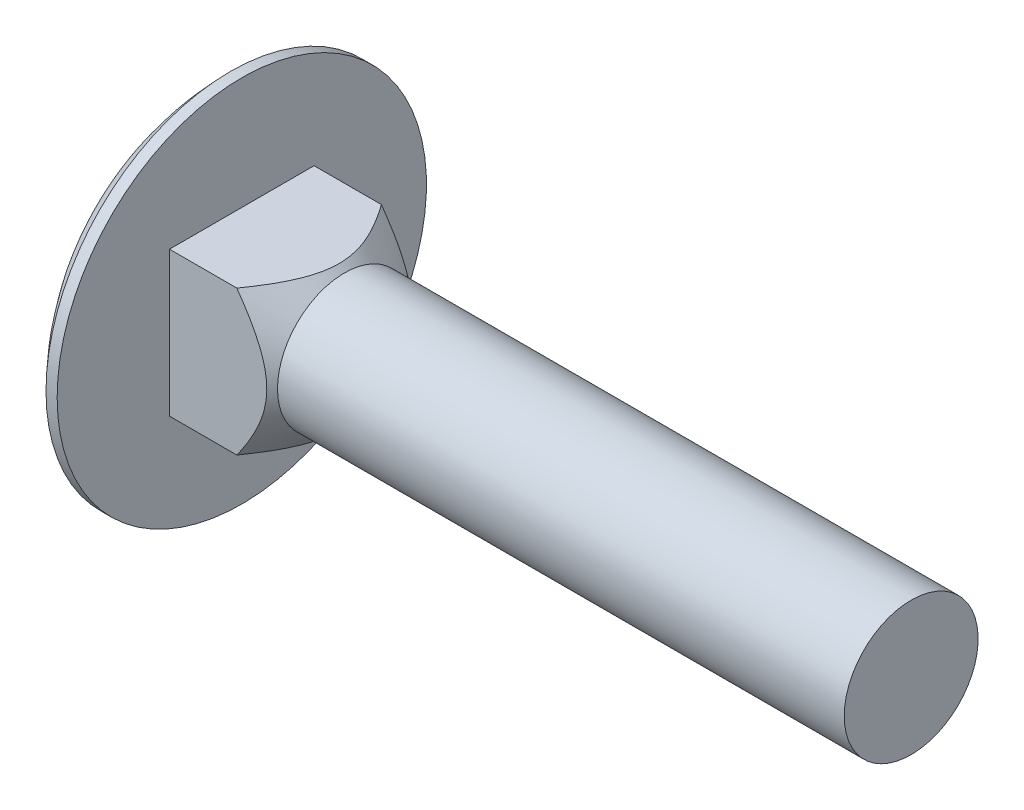
ISO-10303-21;
HEADER;
FILE_DESCRIPTION(('STEP AP214'),'2;1');
FILE_NAME('part.step','',(''),(''),'','','');
FILE_SCHEMA(('AUTOMOTIVE_DESIGN { 1 0 10303 214 1 1 1 1 }'));
ENDSEC;
DATA;
#1=APPLICATION_CONTEXT('core data for automotive mechanical design processes');
#2=APPLICATION_PROTOCOL_DEFINITION('international standard','automotive_design',2000,#1);
#3=PRODUCT_CONTEXT('',#1,'mechanical');
#4=PRODUCT('Part','Part','',(#3));
#5=PRODUCT_RELATED_PRODUCT_CATEGORY('part','',(#4));
#6=PRODUCT_DEFINITION_FORMATION('','',#4);
#7=PRODUCT_DEFINITION_CONTEXT('part definition',#1,'design');
#8=PRODUCT_DEFINITION('design','',#6,#7);
#9=PRODUCT_DEFINITION_SHAPE('','',#8);
#10=(LENGTH_UNIT() NAMED_UNIT(*) SI_UNIT(.MILLI.,.METRE.));
#11=(NAMED_UNIT(*) PLANE_ANGLE_UNIT() SI_UNIT($,.RADIAN.));
#12=(NAMED_UNIT(*) SI_UNIT($,.STERADIAN.) SOLID_ANGLE_UNIT());
#13=UNCERTAINTY_MEASURE_WITH_UNIT(LENGTH_MEASURE(1.E-05),#10,'distance_accuracy_value','');
#14=(GEOMETRIC_REPRESENTATION_CONTEXT(3) GLOBAL_UNCERTAINTY_ASSIGNED_CONTEXT((#13)) GLOBAL_UNIT_ASSIGNED_CONTEXT((#10,
#11,#12)) REPRESENTATION_CONTEXT('',''));
#15=CARTESIAN_POINT('',(0.,0.,0.));
#16=DIRECTION('',(0.,0.,1.));
#17=DIRECTION('',(1.,0.,0.));
#18=AXIS2_PLACEMENT_3D('',#15,#16,#17);
#19=CARTESIAN_POINT('',(4.6,3.24,-3.24));
#20=DIRECTION('',(0.,0.,1.));
#21=DIRECTION('',(0.,-1.,0.));
#22=AXIS2_PLACEMENT_3D('',#19,#20,#21);
#23=PLANE('',#22);
#24=CARTESIAN_POINT('',(0.120416170125069,-6.7414074397063,-3.24));
#25=CARTESIAN_POINT('',(0.25736062873696,-6.58944728740927,-3.24));
#26=CARTESIAN_POINT('',(0.393846815573473,-6.43707070925382,-3.24));
#27=CARTESIAN_POINT('',(0.665661123863793,-6.1312671177515,-3.24));
#28=CARTESIAN_POINT('',(0.800989152901168,-5.97784002230384,-3.24));
#29=CARTESIAN_POINT('',(1.07065702082592,-5.66924612356482,-3.24));
#30=CARTESIAN_POINT('',(1.20499227924482,-5.51407531108393,-3.24));
#31=CARTESIAN_POINT('',(1.47186716195841,-5.20220433515908,-3.24));
#32=CARTESIAN_POINT('',(1.60440684975769,-5.04550422614131,-3.24));
#33=CARTESIAN_POINT('',(1.87469625252643,-4.72122756794267,-3.24));
#34=CARTESIAN_POINT('',(2.0123128694796,-4.55353979098877,-3.24));
#35=CARTESIAN_POINT('',(2.28420008970127,-4.21547552728753,-3.24));
#36=CARTESIAN_POINT('',(2.41847084769173,-4.04509916546525,-3.24));
#37=CARTESIAN_POINT('',(2.68232627861573,-3.70109336187763,-3.24));
#38=CARTESIAN_POINT('',(2.8119168313737,-3.52746844969524,-3.24));
#39=CARTESIAN_POINT('',(3.06482061537789,-3.17572665708054,-3.24));
#40=CARTESIAN_POINT('',(3.1881354498348,-2.99761094144419,-3.24));
#41=CARTESIAN_POINT('',(3.39832133154884,-2.67722310032235,-3.24));
#42=CARTESIAN_POINT('',(3.48703467285581,-2.53616652454108,-3.24));
#43=CARTESIAN_POINT('',(3.65726255713617,-2.24964032099177,-3.24));
#44=CARTESIAN_POINT('',(3.73877395380492,-2.10416880139295,-3.24));
#45=CARTESIAN_POINT('',(3.89115652633997,-1.80934032100822,-3.24));
#46=CARTESIAN_POINT('',(3.9621164219209,-1.6600298009873,-3.24));
#47=CARTESIAN_POINT('',(4.09050683146268,-1.35569473684555,-3.24));
#48=CARTESIAN_POINT('',(4.14795039693274,-1.20067587347206,-3.24));
#49=CARTESIAN_POINT('',(4.22558846779131,-0.947273628729252,-3.24));
#50=CARTESIAN_POINT('',(4.25153996125965,-0.850655334613169,-3.24));
#51=CARTESIAN_POINT('',(4.29568982309763,-0.655648600709393,-3.24));
#52=CARTESIAN_POINT('',(4.31388942032129,-0.557260444064855,-3.24));
#53=CARTESIAN_POINT('',(4.34156684156055,-0.359610820542335,-3.24));
#54=CARTESIAN_POINT('',(4.35107602439263,-0.260353808887043,-3.24));
#55=CARTESIAN_POINT('',(4.36094183170725,-0.0613794653984506,-3.24));
#56=CARTESIAN_POINT('',(4.36129862388183,0.0383378579674386,-3.24));
#57=CARTESIAN_POINT('',(4.35283832123334,0.237378603091908,-3.24));
#58=CARTESIAN_POINT('',(4.34402096142676,0.336702013389639,-3.24));
#59=CARTESIAN_POINT('',(4.31771918406241,0.534183700378543,-3.24));
#60=CARTESIAN_POINT('',(4.30023406582596,0.632341882218774,-3.24));
#61=CARTESIAN_POINT('',(4.2573945237995,0.827349246915,-3.24));
#62=CARTESIAN_POINT('',(4.23200622025648,0.92419088407423,-3.24));
#63=CARTESIAN_POINT('',(4.17446445699154,1.11581908212014,-3.24));
#64=CARTESIAN_POINT('',(4.14231079903122,1.21060558269742,-3.24));
#65=CARTESIAN_POINT('',(4.06453950116689,1.41886565569307,-3.24));
#66=CARTESIAN_POINT('',(4.01751768475131,1.53181153534013,-3.24));
#67=CARTESIAN_POINT('',(3.91671541361205,1.75467118579228,-3.24));
#68=CARTESIAN_POINT('',(3.86293162642795,1.86458342875213,-3.24));
#69=CARTESIAN_POINT('',(3.74994199449218,2.08181831427032,-3.24));
#70=CARTESIAN_POINT('',(3.6907264258951,2.18913586031061,-3.24));
#71=CARTESIAN_POINT('',(3.56808414719841,2.4012987068335,-3.24));
#72=CARTESIAN_POINT('',(3.50465808606051,2.506144384944,-3.24));
#73=CARTESIAN_POINT('',(3.37351714683084,2.71519344454569,-3.24));
#74=CARTESIAN_POINT('',(3.30575408304881,2.81936645688851,-3.24));
#75=CARTESIAN_POINT('',(3.16745091463218,3.02584962244193,-3.24));
#76=CARTESIAN_POINT('',(3.09691072677368,3.12815971969076,-3.24));
#77=CARTESIAN_POINT('',(2.95366014171693,3.33107037702131,-3.24));
#78=CARTESIAN_POINT('',(2.88095230175738,3.4316727476446,-3.24));
#79=CARTESIAN_POINT('',(2.73369585527417,3.63151137580475,-3.24));
#80=CARTESIAN_POINT('',(2.65914732418408,3.73074768906542,-3.24));
#81=CARTESIAN_POINT('',(2.48904411673983,3.95356950466048,-3.24));
#82=CARTESIAN_POINT('',(2.3930434080346,4.07681415039384,-3.24));
#83=CARTESIAN_POINT('',(2.19910117753357,4.32176885465257,-3.24));
#84=CARTESIAN_POINT('',(2.10115959026957,4.44347886118535,-3.24));
#85=CARTESIAN_POINT('',(1.80496346206786,4.80672536138743,-3.24));
#86=CARTESIAN_POINT('',(1.60436164100984,5.04634718705188,-3.24));
#87=CARTESIAN_POINT('',(1.19880495079559,5.52205280844775,-3.24));
#88=CARTESIAN_POINT('',(0.99384804230474,5.75813485425661,-3.24));
#89=CARTESIAN_POINT('',(0.580866742988496,6.22760655736332,-3.24));
#90=CARTESIAN_POINT('',(0.372842273678394,6.46099614550038,-3.24));
#91=CARTESIAN_POINT('',(-0.0459273377027709,6.92624626345974,-3.24));
#92=CARTESIAN_POINT('',(-0.256677452858743,7.15810230761016,-3.24));
#93=CARTESIAN_POINT('',(-0.679912188418046,7.62023065825678,-3.24));
#94=CARTESIAN_POINT('',(-0.892396836514393,7.85050293935853,-3.24));
#95=CARTESIAN_POINT('',(-1.53171588603127,8.53932562776742,-3.24));
#96=CARTESIAN_POINT('',(-1.96054444439081,8.99602419698945,-3.24));
#97=CARTESIAN_POINT('',(-2.7673025022011,9.8488450921901,-3.24));
#98=CARTESIAN_POINT('',(-3.14483337056159,10.245345825622,-3.24));
#99=CARTESIAN_POINT('',(-3.90178375614314,11.0366083515061,-3.24));
#100=CARTESIAN_POINT('',(-4.28120344027272,11.4313699842537,-3.24));
#101=CARTESIAN_POINT('',(-5.03996312949916,12.2180953360151,-3.24));
#102=CARTESIAN_POINT('',(-5.41929802192966,12.6100639911261,-3.24));
#103=CARTESIAN_POINT('',(-6.17897101237118,13.3929516667823,-3.24));
#104=CARTESIAN_POINT('',(-6.55930900565716,13.7838707889211,-3.24));
#105=CARTESIAN_POINT('',(-6.94001542155328,14.1744293874219,-3.24));
#106=B_SPLINE_CURVE_WITH_KNOTS('',3,(#24,#25,#26,#27,#28,#29,#30,#31,#32,#33,#34,#35,#36,#37,
#38,#39,#40,#41,#42,#43,#44,#45,#46,#47,#48,#49,#50,#51,#52,#53,#54,#55,#56,#57,#58,#59,#60,#61,
#62,#63,#64,#65,#66,#67,#68,#69,#70,#71,#72,#73,#74,#75,#76,#77,#78,#79,#80,#81,#82,#83,#84,#85,
#86,#87,#88,#89,#90,#91,#92,#93,#94,#95,#96,#97,#98,#99,#100,#101,#102,#103,#104,#105),
.UNSPECIFIED.,.F.,.F.,(4,2,2,2,2,2,2,2,2,2,2,2,2,2,2,2,2,2,2,2,2,2,2,2,2,2,2,2,2,2,2,2,2,2,2,2,
2,2,2,2,4),(0.,0.613689317340484,1.22742715643208,1.84313970014903,2.45883041058956,
3.10958114212511,3.76030172505684,4.41017414568678,5.05987970622939,5.55962946354488,
6.05959647742213,6.5550877515697,7.05009859249719,7.3499622059646,7.64977826643814,
7.94850813791696,8.24723253599984,8.54596556258943,8.84472274190593,9.14477870724488,
9.44484346604788,9.81158365654415,10.1785052990716,10.5460971159382,10.9136324069677,
11.2863975997142,11.6591739718763,12.0315267342691,12.403864262477,12.872505272666,
13.3411621176853,14.2785938914772,15.2164747516066,16.1543796495519,17.0943450525182,
18.0343254921471,19.9137100660878,21.5561663210808,23.1987703864368,24.8351697964812,
26.471404639992),.UNSPECIFIED.);
#107=CARTESIAN_POINT('',(3.01794805791106,-3.24,-3.24000000000061));
#108=VERTEX_POINT('',#107);
#109=CARTESIAN_POINT('',(3.01794805791106,3.24,-3.24000000000061));
#110=VERTEX_POINT('',#109);
#111=EDGE_CURVE('E112',#108,#110,#106,.T.);
#112=ORIENTED_EDGE('',*,*,#111,.F.);
#113=DIRECTION('',(-1.,0.,0.));
#114=VECTOR('',#113,1.);
#115=CARTESIAN_POINT('',(4.6,-3.24,-3.24));
#116=LINE('',#115,#114);
#117=CARTESIAN_POINT('',(0.,-3.24,-3.24));
#118=VERTEX_POINT('',#117);
#119=EDGE_CURVE('E121',#108,#118,#116,.T.);
#120=ORIENTED_EDGE('',*,*,#119,.T.);
#121=DIRECTION('',(0.,1.,0.));
#122=VECTOR('',#121,1.);
#123=CARTESIAN_POINT('',(0.,3.24,-3.24));
#124=LINE('',#123,#122);
#125=CARTESIAN_POINT('',(0.,3.24,-3.24));
#126=VERTEX_POINT('',#125);
#127=EDGE_CURVE('E124',#118,#126,#124,.T.);
#128=ORIENTED_EDGE('',*,*,#127,.T.);
#129=DIRECTION('',(-1.,0.,0.));
#130=VECTOR('',#129,1.);
#131=CARTESIAN_POINT('',(4.6,3.24,-3.24));
#132=LINE('',#131,#130);
#133=EDGE_CURVE('E86',#110,#126,#132,.T.);
#134=ORIENTED_EDGE('',*,*,#133,.F.);
#135=EDGE_LOOP('',(#112,#120,#128,#134));
#136=FACE_BOUND('',#135,.T.);
#137=ADVANCED_FACE('F56',(#136),#23,.F.);
#138=CARTESIAN_POINT('',(4.6,3.24,3.24));
#139=DIRECTION('',(0.,-1.,0.));
#140=DIRECTION('',(0.,0.,-1.));
#141=AXIS2_PLACEMENT_3D('',#138,#139,#140);
#142=PLANE('',#141);
#143=CARTESIAN_POINT('',(0.120416397012247,3.24,-6.74140718797523));
#144=CARTESIAN_POINT('',(0.25736084617149,3.24,-6.5894470451034));
#145=CARTESIAN_POINT('',(0.393847023566096,3.24,-6.43707047638589));
#146=CARTESIAN_POINT('',(0.665661313010063,3.24,-6.13126690380304));
#147=CARTESIAN_POINT('',(0.800989332643002,3.24,-5.97783981783692));
#148=CARTESIAN_POINT('',(1.07065718176657,3.24,-5.66924593817143));
#149=CARTESIAN_POINT('',(1.20499243078909,3.24,-5.51407513528287));
#150=CARTESIAN_POINT('',(1.47186729479663,3.24,-5.2022041786282));
#151=CARTESIAN_POINT('',(1.60440697328623,3.24,-5.04550407928825));
#152=CARTESIAN_POINT('',(1.87469635953515,3.24,-4.72122743813245));
#153=CARTESIAN_POINT('',(2.01231296924024,3.24,-4.5535396685128));
#154=CARTESIAN_POINT('',(2.28420017506167,3.24,-4.21547541958202));
#155=CARTESIAN_POINT('',(2.41847092589994,3.24,-4.04509906519593));
#156=CARTESIAN_POINT('',(2.68232634270415,3.24,-3.70109327662581));
#157=CARTESIAN_POINT('',(2.81191688849407,3.24,-3.52746837202434));
#158=CARTESIAN_POINT('',(3.06482065885818,3.24,-3.17572659482914));
#159=CARTESIAN_POINT('',(3.18813548664283,3.24,-2.9976108870312));
#160=CARTESIAN_POINT('',(3.39832137140359,3.24,-2.67722303827205));
#161=CARTESIAN_POINT('',(3.48703472147538,3.24,-2.53616644637704));
#162=CARTESIAN_POINT('',(3.65726262123822,3.24,-2.24964020941729));
#163=CARTESIAN_POINT('',(3.73877402462226,3.24,-2.10416867252039));
#164=CARTESIAN_POINT('',(3.89115660683942,3.24,-1.80934015718243));
#165=CARTESIAN_POINT('',(3.96211650547658,3.24,-1.66002961955079));
#166=CARTESIAN_POINT('',(4.09050691644272,3.24,-1.35569451884629));
#167=CARTESIAN_POINT('',(4.14795048029365,3.24,-1.20067563652576));
#168=CARTESIAN_POINT('',(4.22558854094651,3.24,-0.947273368688294));
#169=CARTESIAN_POINT('',(4.25154002842363,3.24,-0.850655070821967));
#170=CARTESIAN_POINT('',(4.29568987701632,3.24,-0.655648329724568));
#171=CARTESIAN_POINT('',(4.31388946698645,3.24,-0.557260169636679));
#172=CARTESIAN_POINT('',(4.3415668726833,3.24,-0.359610539727296));
#173=CARTESIAN_POINT('',(4.35107604722261,3.24,-0.260353525125297));
#174=CARTESIAN_POINT('',(4.36094183727395,3.24,-0.0613791765202277));
#175=CARTESIAN_POINT('',(4.36129862047733,3.24,0.0383381490154808));
#176=CARTESIAN_POINT('',(4.35283829977402,3.24,0.237378896931347));
#177=CARTESIAN_POINT('',(4.34402093094838,3.24,0.336702307853424));
#178=CARTESIAN_POINT('',(4.31771913602471,3.24,0.534183995381723));
#179=CARTESIAN_POINT('',(4.30023400924767,3.24,0.632342177136899));
#180=CARTESIAN_POINT('',(4.2573944508867,3.24,0.827349541250184));
#181=CARTESIAN_POINT('',(4.23200613954735,3.24,0.924191177908111));
#182=CARTESIAN_POINT('',(4.17446436161367,3.24,1.11581937468146));
#183=CARTESIAN_POINT('',(4.14231069678194,3.24,1.21060587448777));
#184=CARTESIAN_POINT('',(4.06453937359323,3.24,1.41886597532059));
#185=CARTESIAN_POINT('',(4.01751753675131,3.24,1.53181188273558));
#186=CARTESIAN_POINT('',(3.9167152228558,3.24,1.75467158732018));
#187=CARTESIAN_POINT('',(3.86293141333946,3.24,1.86458385664321));
#188=CARTESIAN_POINT('',(3.74994173551611,3.24,2.08181879394348));
#189=CARTESIAN_POINT('',(3.69072614335789,3.24,2.18913636539877));
#190=CARTESIAN_POINT('',(3.56808381687153,3.24,2.40129926196509));
#191=CARTESIAN_POINT('',(3.50465773150558,3.24,2.50614496470436));
#192=CARTESIAN_POINT('',(3.37351674319998,3.24,2.71519407318998));
#193=CARTESIAN_POINT('',(3.30575365457046,3.24,2.81936710978396));
#194=CARTESIAN_POINT('',(3.16745043625327,3.24,3.0258503234668));
#195=CARTESIAN_POINT('',(3.09691022334166,3.24,3.12816044459382));
#196=CARTESIAN_POINT('',(2.95365958814427,3.24,3.33107114935379));
#197=CARTESIAN_POINT('',(2.88095172309835,3.24,3.43167354352932));
#198=CARTESIAN_POINT('',(2.73369522641253,3.24,3.63151221862995));
#199=CARTESIAN_POINT('',(2.65914667020615,3.24,3.73074855527884));
#200=CARTESIAN_POINT('',(2.48904343477153,3.24,3.95357038594087));
#201=CARTESIAN_POINT('',(2.39304272392734,3.24,4.0768150238814));
#202=CARTESIAN_POINT('',(2.19910049024907,3.24,4.32176971330541));
#203=CARTESIAN_POINT('',(2.1011589019469,3.24,4.44347971279636));
#204=CARTESIAN_POINT('',(1.80496277189464,3.24,4.80672619272812));
#205=CARTESIAN_POINT('',(1.6043609512619,3.24,5.04634800605598));
#206=CARTESIAN_POINT('',(1.19880426395377,3.24,5.52205360419646));
#207=CARTESIAN_POINT('',(0.993847357946783,3.24,5.75813563908907));
#208=CARTESIAN_POINT('',(0.580866064862754,3.24,6.2276073213903));
#209=CARTESIAN_POINT('',(0.372841599301107,3.24,6.46099689963823));
#210=CARTESIAN_POINT('',(-0.0459280034415185,3.24,6.92624699817664));
#211=CARTESIAN_POINT('',(-0.256678113702332,3.24,7.15810303279974));
#212=CARTESIAN_POINT('',(-0.67991283888425,3.24,7.6202313648977));
#213=CARTESIAN_POINT('',(-0.892397481498328,3.24,7.85050363697815));
#214=CARTESIAN_POINT('',(-1.53171651409696,3.24,8.53932629901567));
#215=CARTESIAN_POINT('',(-1.96054506041448,3.24,8.99602485142915));
#216=CARTESIAN_POINT('',(-2.76730311748959,3.24,9.84884573981253));
#217=CARTESIAN_POINT('',(-3.14483399741388,3.24,10.245346482994));
#218=CARTESIAN_POINT('',(-3.90178440585234,3.24,11.0366090285592));
#219=CARTESIAN_POINT('',(-4.28120410127485,3.24,11.4313706712386));
#220=CARTESIAN_POINT('',(-5.03996381385811,3.24,12.2180960439803));
#221=CARTESIAN_POINT('',(-5.41929871835656,3.24,12.6100647101359));
#222=CARTESIAN_POINT('',(-6.178971732859,3.24,13.3929524080208));
#223=CARTESIAN_POINT('',(-6.55930973813807,3.24,13.7838715413436));
#224=CARTESIAN_POINT('',(-6.9400161659924,3.24,14.1744301510615));
#225=B_SPLINE_CURVE_WITH_KNOTS('',3,(#143,#144,#145,#146,#147,#148,#149,#150,#151,#152,#153,
#154,#155,#156,#157,#158,#159,#160,#161,#162,#163,#164,#165,#166,#167,#168,#169,#170,#171,#172,
#173,#174,#175,#176,#177,#178,#179,#180,#181,#182,#183,#184,#185,#186,#187,#188,#189,#190,#191,
#192,#193,#194,#195,#196,#197,#198,#199,#200,#201,#202,#203,#204,#205,#206,#207,#208,#209,#210,
#211,#212,#213,#214,#215,#216,#217,#218,#219,#220,#221,#222,#223,#224),.UNSPECIFIED.,.F.,.F.,(4,
2,2,2,2,2,2,2,2,2,2,2,2,2,2,2,2,2,2,2,2,2,2,2,2,2,2,2,2,2,2,2,2,2,2,2,2,2,2,2,4),(0.,
0.613689277351337,1.22742707644803,1.84313957995817,2.45883025019582,3.10958095092863,
3.76030150306009,4.41017389296157,5.05987942279953,5.55962923497038,6.05959630382794,
6.55508762939305,7.05009852138514,7.34996214097857,7.6497782075645,7.94850808540368,
8.24723248986966,8.54596552074054,8.84472270435129,9.1447786742277,9.44484343752451,
9.81158372833911,10.1785054713109,10.5460973890606,10.9136327809252,11.2863980753046,
11.6591745491081,12.0315274128546,12.4038650424204,12.8725060381386,13.3411628686666,
14.2785946133404,15.2164754438787,16.1543803122098,17.0943456841551,18.0343260927446,
19.9137106052134,21.5561669053119,23.1987710156277,24.8351704746596,26.4714053673087),.UNSPECIFIED.);
#226=CARTESIAN_POINT('',(3.01794805791122,3.24,3.24));
#227=VERTEX_POINT('',#226);
#228=EDGE_CURVE('E125',#110,#227,#225,.T.);
#229=ORIENTED_EDGE('',*,*,#228,.F.);
#230=ORIENTED_EDGE('',*,*,#133,.T.);
#231=DIRECTION('',(0.,0.,1.));
#232=VECTOR('',#231,1.);
#233=CARTESIAN_POINT('',(0.,3.24,3.24));
#234=LINE('',#233,#232);
#235=CARTESIAN_POINT('',(0.,3.24,3.24));
#236=VERTEX_POINT('',#235);
#237=EDGE_CURVE('E163',#126,#236,#234,.T.);
#238=ORIENTED_EDGE('',*,*,#237,.T.);
#239=DIRECTION('',(-1.,0.,0.));
#240=VECTOR('',#239,1.);
#241=CARTESIAN_POINT('',(4.6,3.24,3.24));
#242=LINE('',#241,#240);
#243=EDGE_CURVE('E137',#227,#236,#242,.T.);
#244=ORIENTED_EDGE('',*,*,#243,.F.);
#245=EDGE_LOOP('',(#229,#230,#238,#244));
#246=FACE_BOUND('',#245,.T.);
#247=ADVANCED_FACE('F181',(#246),#142,.F.);
#248=CARTESIAN_POINT('',(4.6,3.24,3.24));
#249=DIRECTION('',(0.,0.,-1.));
#250=DIRECTION('',(0.,1.,0.));
#251=AXIS2_PLACEMENT_3D('',#248,#249,#250);
#252=PLANE('',#251);
#253=CARTESIAN_POINT('',(0.120416397012249,-6.74140718797523,3.24));
#254=CARTESIAN_POINT('',(0.257360846171492,-6.5894470451034,3.24));
#255=CARTESIAN_POINT('',(0.393847023566098,-6.43707047638589,3.24));
#256=CARTESIAN_POINT('',(0.665661313010065,-6.13126690380304,3.24));
#257=CARTESIAN_POINT('',(0.800989332643003,-5.97783981783692,3.24));
#258=CARTESIAN_POINT('',(1.07065718176657,-5.66924593817143,3.24));
#259=CARTESIAN_POINT('',(1.20499243078909,-5.51407513528287,3.24));
#260=CARTESIAN_POINT('',(1.47186729479663,-5.2022041786282,3.24));
#261=CARTESIAN_POINT('',(1.60440697328623,-5.04550407928825,3.24));
#262=CARTESIAN_POINT('',(1.87469635953515,-4.72122743813245,3.24));
#263=CARTESIAN_POINT('',(2.01231296924024,-4.5535396685128,3.24));
#264=CARTESIAN_POINT('',(2.28420017506167,-4.21547541958203,3.24));
#265=CARTESIAN_POINT('',(2.41847092589994,-4.04509906519593,3.24));
#266=CARTESIAN_POINT('',(2.68232634270415,-3.70109327662581,3.24));
#267=CARTESIAN_POINT('',(2.81191688849407,-3.52746837202434,3.24));
#268=CARTESIAN_POINT('',(3.06482065885819,-3.17572659482914,3.24));
#269=CARTESIAN_POINT('',(3.18813548664283,-2.9976108870312,3.24));
#270=CARTESIAN_POINT('',(3.39832137140359,-2.67722303827205,3.24));
#271=CARTESIAN_POINT('',(3.48703472147538,-2.53616644637704,3.24));
#272=CARTESIAN_POINT('',(3.65726262123822,-2.2496402094173,3.24));
#273=CARTESIAN_POINT('',(3.73877402462226,-2.1041686725204,3.24));
#274=CARTESIAN_POINT('',(3.89115660683942,-1.80934015718244,3.24));
#275=CARTESIAN_POINT('',(3.96211650547658,-1.66002961955079,3.24));
#276=CARTESIAN_POINT('',(4.09050691644272,-1.35569451884629,3.24));
#277=CARTESIAN_POINT('',(4.14795048029365,-1.20067563652576,3.24));
#278=CARTESIAN_POINT('',(4.22558854094651,-0.947273368688294,3.24));
#279=CARTESIAN_POINT('',(4.25154002842363,-0.850655070821967,3.24));
#280=CARTESIAN_POINT('',(4.29568987701632,-0.655648329724568,3.24));
#281=CARTESIAN_POINT('',(4.31388946698645,-0.557260169636679,3.24));
#282=CARTESIAN_POINT('',(4.3415668726833,-0.359610539727296,3.24));
#283=CARTESIAN_POINT('',(4.35107604722261,-0.260353525125296,3.24));
#284=CARTESIAN_POINT('',(4.36094183727395,-0.0613791765202274,3.24));
#285=CARTESIAN_POINT('',(4.36129862047733,0.0383381490154812,3.24));
#286=CARTESIAN_POINT('',(4.35283829977402,0.237378896931348,3.24));
#287=CARTESIAN_POINT('',(4.34402093094838,0.336702307853424,3.24));
#288=CARTESIAN_POINT('',(4.31771913602471,0.534183995381724,3.24));
#289=CARTESIAN_POINT('',(4.30023400924767,0.632342177136899,3.24));
#290=CARTESIAN_POINT('',(4.2573944508867,0.827349541250184,3.24));
#291=CARTESIAN_POINT('',(4.23200613954735,0.924191177908111,3.24));
#292=CARTESIAN_POINT('',(4.17446436161367,1.11581937468146,3.24));
#293=CARTESIAN_POINT('',(4.14231069678194,1.21060587448777,3.24));
#294=CARTESIAN_POINT('',(4.06453937359323,1.41886597532059,3.24));
#295=CARTESIAN_POINT('',(4.01751753675131,1.53181188273558,3.24));
#296=CARTESIAN_POINT('',(3.9167152228558,1.75467158732019,3.24));
#297=CARTESIAN_POINT('',(3.86293141333946,1.86458385664321,3.24));
#298=CARTESIAN_POINT('',(3.74994173551611,2.08181879394348,3.24));
#299=CARTESIAN_POINT('',(3.69072614335789,2.18913636539877,3.24));
#300=CARTESIAN_POINT('',(3.56808381687153,2.40129926196509,3.24));
#301=CARTESIAN_POINT('',(3.50465773150558,2.50614496470436,3.24));
#302=CARTESIAN_POINT('',(3.37351674319998,2.71519407318998,3.24));
#303=CARTESIAN_POINT('',(3.30575365457046,2.81936710978397,3.24));
#304=CARTESIAN_POINT('',(3.16745043625327,3.0258503234668,3.24));
#305=CARTESIAN_POINT('',(3.09691022334165,3.12816044459383,3.24));
#306=CARTESIAN_POINT('',(2.95365958814427,3.33107114935379,3.24));
#307=CARTESIAN_POINT('',(2.88095172309835,3.43167354352932,3.24));
#308=CARTESIAN_POINT('',(2.73369522641252,3.63151221862996,3.24));
#309=CARTESIAN_POINT('',(2.65914667020615,3.73074855527884,3.24));
#310=CARTESIAN_POINT('',(2.48904343477153,3.95357038594087,3.24));
#311=CARTESIAN_POINT('',(2.39304272392734,4.0768150238814,3.24));
#312=CARTESIAN_POINT('',(2.19910049024906,4.32176971330541,3.24));
#313=CARTESIAN_POINT('',(2.1011589019469,4.44347971279636,3.24));
#314=CARTESIAN_POINT('',(1.80496277189464,4.80672619272812,3.24));
#315=CARTESIAN_POINT('',(1.6043609512619,5.04634800605598,3.24));
#316=CARTESIAN_POINT('',(1.19880426395377,5.52205360419646,3.24));
#317=CARTESIAN_POINT('',(0.993847357946783,5.75813563908907,3.24));
#318=CARTESIAN_POINT('',(0.580866064862754,6.2276073213903,3.24));
#319=CARTESIAN_POINT('',(0.372841599301108,6.46099689963823,3.24));
#320=CARTESIAN_POINT('',(-0.0459280034415153,6.92624699817664,3.24));
#321=CARTESIAN_POINT('',(-0.256678113702327,7.15810303279974,3.24));
#322=CARTESIAN_POINT('',(-0.679912838884245,7.62023136489769,3.24));
#323=CARTESIAN_POINT('',(-0.892397481498324,7.85050363697815,3.24));
#324=CARTESIAN_POINT('',(-1.53171651409696,8.53932629901566,3.24));
#325=CARTESIAN_POINT('',(-1.96054506041447,8.99602485142915,3.24));
#326=CARTESIAN_POINT('',(-2.76730311748958,9.84884573981252,3.24));
#327=CARTESIAN_POINT('',(-3.14483399741388,10.245346482994,3.24));
#328=CARTESIAN_POINT('',(-3.90178440585233,11.0366090285592,3.24));
#329=CARTESIAN_POINT('',(-4.28120410127485,11.4313706712386,3.24));
#330=CARTESIAN_POINT('',(-5.03996381385811,12.2180960439803,3.24));
#331=CARTESIAN_POINT('',(-5.41929871835656,12.6100647101359,3.24));
#332=CARTESIAN_POINT('',(-6.178971732859,13.3929524080208,3.24));
#333=CARTESIAN_POINT('',(-6.55930973813807,13.7838715413436,3.24));
#334=CARTESIAN_POINT('',(-6.9400161659924,14.1744301510615,3.24));
#335=B_SPLINE_CURVE_WITH_KNOTS('',3,(#253,#254,#255,#256,#257,#258,#259,#260,#261,#262,#263,
#264,#265,#266,#267,#268,#269,#270,#271,#272,#273,#274,#275,#276,#277,#278,#279,#280,#281,#282,
#283,#284,#285,#286,#287,#288,#289,#290,#291,#292,#293,#294,#295,#296,#297,#298,#299,#300,#301,
#302,#303,#304,#305,#306,#307,#308,#309,#310,#311,#312,#313,#314,#315,#316,#317,#318,#319,#320,
#321,#322,#323,#324,#325,#326,#327,#328,#329,#330,#331,#332,#333,#334),.UNSPECIFIED.,.F.,.F.,(4,
2,2,2,2,2,2,2,2,2,2,2,2,2,2,2,2,2,2,2,2,2,2,2,2,2,2,2,2,2,2,2,2,2,2,2,2,2,2,2,4),(0.,
0.613689277351336,1.22742707644803,1.84313957995817,2.45883025019581,3.10958095092863,
3.76030150306009,4.41017389296157,5.05987942279953,5.55962923497037,6.05959630382794,
6.55508762939304,7.05009852138514,7.34996214097857,7.64977820756449,7.94850808540367,
8.24723248986966,8.54596552074054,8.84472270435129,9.14477867422769,9.4448434375245,
9.81158372833911,10.1785054713109,10.5460973890606,10.9136327809252,11.2863980753046,
11.6591745491081,12.0315274128546,12.4038650424204,12.8725060381386,13.3411628686666,
14.2785946133404,15.2164754438787,16.1543803122098,17.094345684155,18.0343260927446,
19.9137106052134,21.5561669053119,23.1987710156277,24.8351704746596,26.4714053673087),.UNSPECIFIED.);
#336=CARTESIAN_POINT('',(3.01794805791122,-3.24,3.24));
#337=VERTEX_POINT('',#336);
#338=EDGE_CURVE('E76',#227,#337,#335,.F.);
#339=ORIENTED_EDGE('',*,*,#338,.F.);
#340=ORIENTED_EDGE('',*,*,#243,.T.);
#341=DIRECTION('',(0.,-1.,0.));
#342=VECTOR('',#341,1.);
#343=CARTESIAN_POINT('',(0.,3.24,3.24));
#344=LINE('',#343,#342);
#345=CARTESIAN_POINT('',(0.,-3.24,3.24));
#346=VERTEX_POINT('',#345);
#347=EDGE_CURVE('E139',#236,#346,#344,.T.);
#348=ORIENTED_EDGE('',*,*,#347,.T.);
#349=DIRECTION('',(-1.,0.,0.));
#350=VECTOR('',#349,1.);
#351=CARTESIAN_POINT('',(4.6,-3.24,3.24));
#352=LINE('',#351,#350);
#353=EDGE_CURVE('E132',#337,#346,#352,.T.);
#354=ORIENTED_EDGE('',*,*,#353,.F.);
#355=EDGE_LOOP('',(#339,#340,#348,#354));
#356=FACE_BOUND('',#355,.T.);
#357=ADVANCED_FACE('F179',(#356),#252,.F.);
#358=CARTESIAN_POINT('',(4.6,-3.24,3.24));
#359=DIRECTION('',(0.,1.,0.));
#360=DIRECTION('',(0.,0.,1.));
#361=AXIS2_PLACEMENT_3D('',#358,#359,#360);
#362=PLANE('',#361);
#363=CARTESIAN_POINT('',(0.120416397012247,-3.24,-6.74140718797523));
#364=CARTESIAN_POINT('',(0.257360846171489,-3.24,-6.5894470451034));
#365=CARTESIAN_POINT('',(0.393847023566095,-3.24,-6.43707047638589));
#366=CARTESIAN_POINT('',(0.665661313010063,-3.24,-6.13126690380304));
#367=CARTESIAN_POINT('',(0.800989332643001,-3.24,-5.97783981783692));
#368=CARTESIAN_POINT('',(1.07065718176657,-3.24,-5.66924593817143));
#369=CARTESIAN_POINT('',(1.20499243078909,-3.24,-5.51407513528287));
#370=CARTESIAN_POINT('',(1.47186729479663,-3.24,-5.2022041786282));
#371=CARTESIAN_POINT('',(1.60440697328623,-3.24,-5.04550407928826));
#372=CARTESIAN_POINT('',(1.87469635953514,-3.24,-4.72122743813245));
#373=CARTESIAN_POINT('',(2.01231296924024,-3.24,-4.55353966851281));
#374=CARTESIAN_POINT('',(2.28420017506166,-3.24,-4.21547541958203));
#375=CARTESIAN_POINT('',(2.41847092589994,-3.24,-4.04509906519593));
#376=CARTESIAN_POINT('',(2.68232634270414,-3.24,-3.70109327662581));
#377=CARTESIAN_POINT('',(2.81191688849407,-3.24,-3.52746837202434));
#378=CARTESIAN_POINT('',(3.06482065885818,-3.24,-3.17572659482914));
#379=CARTESIAN_POINT('',(3.18813548664283,-3.24,-2.9976108870312));
#380=CARTESIAN_POINT('',(3.39832137140359,-3.24,-2.67722303827205));
#381=CARTESIAN_POINT('',(3.48703472147538,-3.24,-2.53616644637704));
#382=CARTESIAN_POINT('',(3.65726262123822,-3.24,-2.24964020941729));
#383=CARTESIAN_POINT('',(3.73877402462226,-3.24,-2.1041686725204));
#384=CARTESIAN_POINT('',(3.89115660683942,-3.24,-1.80934015718243));
#385=CARTESIAN_POINT('',(3.96211650547658,-3.24,-1.66002961955079));
#386=CARTESIAN_POINT('',(4.09050691644272,-3.24,-1.35569451884629));
#387=CARTESIAN_POINT('',(4.14795048029365,-3.24,-1.20067563652575));
#388=CARTESIAN_POINT('',(4.22558854094651,-3.24,-0.947273368688292));
#389=CARTESIAN_POINT('',(4.25154002842363,-3.24,-0.850655070821965));
#390=CARTESIAN_POINT('',(4.29568987701632,-3.24,-0.655648329724566));
#391=CARTESIAN_POINT('',(4.31388946698645,-3.24,-0.557260169636678));
#392=CARTESIAN_POINT('',(4.3415668726833,-3.24,-0.359610539727294));
#393=CARTESIAN_POINT('',(4.35107604722261,-3.24,-0.260353525125294));
#394=CARTESIAN_POINT('',(4.36094183727395,-3.24,-0.0613791765202251));
#395=CARTESIAN_POINT('',(4.36129862047733,-3.24,0.0383381490154832));
#396=CARTESIAN_POINT('',(4.35283829977402,-3.24,0.23737889693135));
#397=CARTESIAN_POINT('',(4.34402093094838,-3.24,0.336702307853426));
#398=CARTESIAN_POINT('',(4.3177191360247,-3.24,0.534183995381726));
#399=CARTESIAN_POINT('',(4.30023400924767,-3.24,0.632342177136901));
#400=CARTESIAN_POINT('',(4.2573944508867,-3.24,0.827349541250186));
#401=CARTESIAN_POINT('',(4.23200613954735,-3.24,0.924191177908113));
#402=CARTESIAN_POINT('',(4.17446436161367,-3.24,1.11581937468146));
#403=CARTESIAN_POINT('',(4.14231069678194,-3.24,1.21060587448777));
#404=CARTESIAN_POINT('',(4.06453937359323,-3.24,1.41886597532059));
#405=CARTESIAN_POINT('',(4.01751753675131,-3.24,1.53181188273558));
#406=CARTESIAN_POINT('',(3.9167152228558,-3.24,1.75467158732019));
#407=CARTESIAN_POINT('',(3.86293141333946,-3.24,1.86458385664321));
#408=CARTESIAN_POINT('',(3.74994173551611,-3.24,2.08181879394348));
#409=CARTESIAN_POINT('',(3.69072614335788,-3.24,2.18913636539878));
#410=CARTESIAN_POINT('',(3.56808381687153,-3.24,2.4012992619651));
#411=CARTESIAN_POINT('',(3.50465773150557,-3.24,2.50614496470436));
#412=CARTESIAN_POINT('',(3.37351674319998,-3.24,2.71519407318998));
#413=CARTESIAN_POINT('',(3.30575365457046,-3.24,2.81936710978397));
#414=CARTESIAN_POINT('',(3.16745043625327,-3.24,3.0258503234668));
#415=CARTESIAN_POINT('',(3.09691022334165,-3.24,3.12816044459383));
#416=CARTESIAN_POINT('',(2.95365958814427,-3.24,3.3310711493538));
#417=CARTESIAN_POINT('',(2.88095172309834,-3.24,3.43167354352933));
#418=CARTESIAN_POINT('',(2.73369522641252,-3.24,3.63151221862996));
#419=CARTESIAN_POINT('',(2.65914667020614,-3.24,3.73074855527885));
#420=CARTESIAN_POINT('',(2.48904343477153,-3.24,3.95357038594088));
#421=CARTESIAN_POINT('',(2.39304272392734,-3.24,4.07681502388141));
#422=CARTESIAN_POINT('',(2.19910049024906,-3.24,4.32176971330541));
#423=CARTESIAN_POINT('',(2.10115890194689,-3.24,4.44347971279637));
#424=CARTESIAN_POINT('',(1.80496277189464,-3.24,4.80672619272813));
#425=CARTESIAN_POINT('',(1.60436095126189,-3.24,5.04634800605599));
#426=CARTESIAN_POINT('',(1.19880426395376,-3.24,5.52205360419647));
#427=CARTESIAN_POINT('',(0.993847357946778,-3.24,5.75813563908907));
#428=CARTESIAN_POINT('',(0.580866064862749,-3.24,6.22760732139031));
#429=CARTESIAN_POINT('',(0.372841599301102,-3.24,6.46099689963824));
#430=CARTESIAN_POINT('',(-0.0459280034415223,-3.24,6.92624699817665));
#431=CARTESIAN_POINT('',(-0.256678113702335,-3.24,7.15810303279975));
#432=CARTESIAN_POINT('',(-0.679912838884253,-3.24,7.6202313648977));
#433=CARTESIAN_POINT('',(-0.892397481498333,-3.24,7.85050363697815));
#434=CARTESIAN_POINT('',(-1.53171651409697,-3.24,8.53932629901567));
#435=CARTESIAN_POINT('',(-1.96054506041448,-3.24,8.99602485142916));
#436=CARTESIAN_POINT('',(-2.76730311748959,-3.24,9.84884573981254));
#437=CARTESIAN_POINT('',(-3.14483399741389,-3.24,10.245346482994));
#438=CARTESIAN_POINT('',(-3.90178440585234,-3.24,11.0366090285592));
#439=CARTESIAN_POINT('',(-4.28120410127486,-3.24,11.4313706712386));
#440=CARTESIAN_POINT('',(-5.03996381385812,-3.24,12.2180960439803));
#441=CARTESIAN_POINT('',(-5.41929871835657,-3.24,12.6100647101359));
#442=CARTESIAN_POINT('',(-6.17897173285901,-3.24,13.3929524080208));
#443=CARTESIAN_POINT('',(-6.55930973813808,-3.24,13.7838715413436));
#444=CARTESIAN_POINT('',(-6.94001616599241,-3.24,14.1744301510616));
#445=B_SPLINE_CURVE_WITH_KNOTS('',3,(#363,#364,#365,#366,#367,#368,#369,#370,#371,#372,#373,
#374,#375,#376,#377,#378,#379,#380,#381,#382,#383,#384,#385,#386,#387,#388,#389,#390,#391,#392,
#393,#394,#395,#396,#397,#398,#399,#400,#401,#402,#403,#404,#405,#406,#407,#408,#409,#410,#411,
#412,#413,#414,#415,#416,#417,#418,#419,#420,#421,#422,#423,#424,#425,#426,#427,#428,#429,#430,
#431,#432,#433,#434,#435,#436,#437,#438,#439,#440,#441,#442,#443,#444),.UNSPECIFIED.,.F.,.F.,(4,
2,2,2,2,2,2,2,2,2,2,2,2,2,2,2,2,2,2,2,2,2,2,2,2,2,2,2,2,2,2,2,2,2,2,2,2,2,2,2,4),(0.,
0.613689277351337,1.22742707644803,1.84313957995817,2.45883025019582,3.10958095092863,
3.76030150306009,4.41017389296157,5.05987942279953,5.55962923497038,6.05959630382794,
6.55508762939305,7.05009852138514,7.34996214097858,7.6497782075645,7.94850808540368,
8.24723248986967,8.54596552074054,8.84472270435129,9.1447786742277,9.44484343752451,
9.81158372833912,10.1785054713109,10.5460973890606,10.9136327809252,11.2863980753046,
11.6591745491081,12.0315274128546,12.4038650424204,12.8725060381386,13.3411628686666,
14.2785946133404,15.2164754438788,16.1543803122098,17.0943456841551,18.0343260927446,
19.9137106052134,21.5561669053119,23.1987710156277,24.8351704746596,26.4714053673087),.UNSPECIFIED.);
#446=EDGE_CURVE('E109',#337,#108,#445,.F.);
#447=ORIENTED_EDGE('',*,*,#446,.F.);
#448=ORIENTED_EDGE('',*,*,#353,.T.);
#449=DIRECTION('',(0.,0.,-1.));
#450=VECTOR('',#449,1.);
#451=CARTESIAN_POINT('',(0.,-3.24,3.24));
#452=LINE('',#451,#450);
#453=EDGE_CURVE('E130',#346,#118,#452,.T.);
#454=ORIENTED_EDGE('',*,*,#453,.T.);
#455=ORIENTED_EDGE('',*,*,#119,.F.);
#456=EDGE_LOOP('',(#447,#448,#454,#455));
#457=FACE_BOUND('',#456,.T.);
#458=ADVANCED_FACE('F128',(#457),#362,.F.);
#459=CARTESIAN_POINT('',(0.,3.,0.));
#460=DIRECTION('',(-1.,0.,0.));
#461=DIRECTION('',(0.,0.,1.));
#462=AXIS2_PLACEMENT_3D('',#459,#460,#461);
#463=PLANE('',#462);
#464=CARTESIAN_POINT('',(0.,0.,0.));
#465=DIRECTION('',(-1.,0.,0.));
#466=DIRECTION('',(0.,0.,1.));
#467=AXIS2_PLACEMENT_3D('',#464,#465,#466);
#468=CIRCLE('',#467,8.275);
#469=CARTESIAN_POINT('',(0.,0.,8.275));
#470=VERTEX_POINT('',#469);
#471=EDGE_CURVE('E65',#470,#470,#468,.T.);
#472=ORIENTED_EDGE('',*,*,#471,.F.);
#473=EDGE_LOOP('',(#472));
#474=FACE_BOUND('',#473,.T.);
#475=ORIENTED_EDGE('',*,*,#127,.F.);
#476=ORIENTED_EDGE('',*,*,#453,.F.);
#477=ORIENTED_EDGE('',*,*,#347,.F.);
#478=ORIENTED_EDGE('',*,*,#237,.F.);
#479=EDGE_LOOP('',(#475,#476,#477,#478));
#480=FACE_BOUND('',#479,.T.);
#481=ADVANCED_FACE('F157',(#474,#480),#463,.F.);
#482=CARTESIAN_POINT('',(-946.390579576086,0.,0.));
#483=DIRECTION('',(-1.,0.,0.));
#484=DIRECTION('',(0.,0.,1.));
#485=AXIS2_PLACEMENT_3D('',#482,#483,#484);
#486=CYLINDRICAL_SURFACE('',#485,8.27499999994819);
#487=CARTESIAN_POINT('',(-0.499999999894363,0.,0.));
#488=DIRECTION('',(-1.,0.,0.));
#489=DIRECTION('',(0.,0.,1.));
#490=AXIS2_PLACEMENT_3D('',#487,#488,#489);
#491=CIRCLE('',#490,8.27499999989639);
#492=CARTESIAN_POINT('',(-0.499999999894363,0.,8.27499999989639));
#493=VERTEX_POINT('',#492);
#494=EDGE_CURVE('E147',#493,#493,#491,.T.);
#495=ORIENTED_EDGE('',*,*,#494,.F.);
#496=EDGE_LOOP('',(#495));
#497=FACE_BOUND('',#496,.T.);
#498=ORIENTED_EDGE('',*,*,#471,.T.);
#499=EDGE_LOOP('',(#498));
#500=FACE_BOUND('',#499,.T.);
#501=ADVANCED_FACE('F155',(#497,#500),#486,.T.);
#502=CARTESIAN_POINT('',(7.93953032440874,0.,0.));
#503=DIRECTION('',(-1.,0.,0.));
#504=DIRECTION('',(0.,1.,0.));
#505=AXIS2_PLACEMENT_3D('',#502,#503,#504);
#506=SPHERICAL_SURFACE('',#505,11.8195303245567);
#507=ORIENTED_EDGE('',*,*,#494,.T.);
#508=EDGE_LOOP('',(#507));
#509=FACE_BOUND('',#508,.T.);
#510=ADVANCED_FACE('F200',(#509),#506,.T.);
#511=CARTESIAN_POINT('',(4.60000000000005,0.,0.));
#512=DIRECTION('',(-1.,0.,0.));
#513=DIRECTION('',(0.,0.,1.));
#514=AXIS2_PLACEMENT_3D('',#511,#512,#513);
#515=CONICAL_SURFACE('',#514,3.,0.78539816339745);
#516=CARTESIAN_POINT('',(4.60000000000005,0.,0.));
#517=DIRECTION('',(1.,0.,0.));
#518=DIRECTION('',(0.,0.,-1.));
#519=AXIS2_PLACEMENT_3D('',#516,#517,#518);
#520=CIRCLE('',#519,3.);
#521=CARTESIAN_POINT('',(4.60000000000005,0.,-3.));
#522=VERTEX_POINT('',#521);
#523=EDGE_CURVE('E117',#522,#522,#520,.T.);
#524=ORIENTED_EDGE('',*,*,#523,.F.);
#525=EDGE_LOOP('',(#524));
#526=FACE_BOUND('',#525,.T.);
#527=ORIENTED_EDGE('',*,*,#111,.T.);
#528=ORIENTED_EDGE('',*,*,#228,.T.);
#529=ORIENTED_EDGE('',*,*,#338,.T.);
#530=ORIENTED_EDGE('',*,*,#446,.T.);
#531=EDGE_LOOP('',(#527,#528,#529,#530));
#532=FACE_BOUND('',#531,.T.);
#533=ADVANCED_FACE('F111',(#526,#532),#515,.T.);
#534=CARTESIAN_POINT('',(30.,0.,0.));
#535=DIRECTION('',(-1.,0.,0.));
#536=DIRECTION('',(0.,0.,1.));
#537=AXIS2_PLACEMENT_3D('',#534,#535,#536);
#538=PLANE('',#537);
#539=CARTESIAN_POINT('',(30.,0.,0.));
#540=DIRECTION('',(-1.,0.,0.));
#541=DIRECTION('',(0.,0.,1.));
#542=AXIS2_PLACEMENT_3D('',#539,#540,#541);
#543=CIRCLE('',#542,3.);
#544=CARTESIAN_POINT('',(30.,0.,3.));
#545=VERTEX_POINT('',#544);
#546=EDGE_CURVE('E13',#545,#545,#543,.T.);
#547=ORIENTED_EDGE('',*,*,#546,.F.);
#548=EDGE_LOOP('',(#547));
#549=FACE_BOUND('',#548,.T.);
#550=ADVANCED_FACE('F58',(#549),#538,.F.);
#551=CARTESIAN_POINT('',(-946.390579576086,0.,0.));
#552=DIRECTION('',(-1.,0.,0.));
#553=DIRECTION('',(0.,0.,1.));
#554=AXIS2_PLACEMENT_3D('',#551,#552,#553);
#555=CYLINDRICAL_SURFACE('',#554,3.);
#556=ORIENTED_EDGE('',*,*,#523,.T.);
#557=EDGE_LOOP('',(#556));
#558=FACE_BOUND('',#557,.T.);
#559=ORIENTED_EDGE('',*,*,#546,.T.);
#560=EDGE_LOOP('',(#559));
#561=FACE_BOUND('',#560,.T.);
#562=ADVANCED_FACE('F215',(#558,#561),#555,.T.);
#563=CLOSED_SHELL('',(#137,#247,#357,#458,#481,#501,#510,#533,#550,#562));
#564=MANIFOLD_SOLID_BREP('B2',#563);
#565=ADVANCED_BREP_SHAPE_REPRESENTATION('',(#18,#564),#14);
#566=SHAPE_DEFINITION_REPRESENTATION(#9,#565);
ENDSEC;
END-ISO-10303-21;
